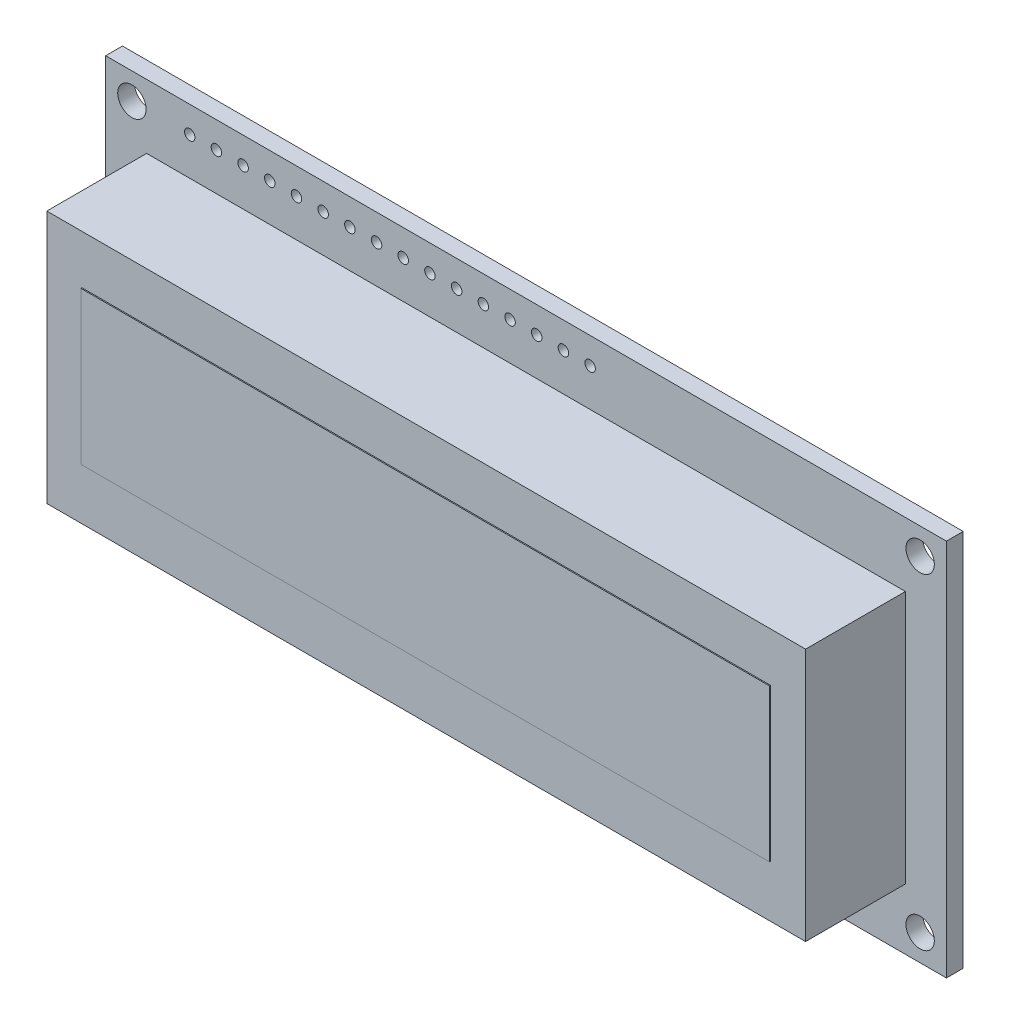
ISO-10303-21;
HEADER;
FILE_DESCRIPTION(('STEP AP214'),'2;1');
FILE_NAME('part.step','',(''),(''),'','','');
FILE_SCHEMA(('AUTOMOTIVE_DESIGN { 1 0 10303 214 1 1 1 1 }'));
ENDSEC;
DATA;
#1=APPLICATION_CONTEXT('core data for automotive mechanical design processes');
#2=APPLICATION_PROTOCOL_DEFINITION('international standard','automotive_design',2000,#1);
#3=PRODUCT_CONTEXT('',#1,'mechanical');
#4=PRODUCT('Part','Part','',(#3));
#5=PRODUCT_RELATED_PRODUCT_CATEGORY('part','',(#4));
#6=PRODUCT_DEFINITION_FORMATION('','',#4);
#7=PRODUCT_DEFINITION_CONTEXT('part definition',#1,'design');
#8=PRODUCT_DEFINITION('design','',#6,#7);
#9=PRODUCT_DEFINITION_SHAPE('','',#8);
#10=(LENGTH_UNIT() NAMED_UNIT(*) SI_UNIT(.MILLI.,.METRE.));
#11=(NAMED_UNIT(*) PLANE_ANGLE_UNIT() SI_UNIT($,.RADIAN.));
#12=(NAMED_UNIT(*) SI_UNIT($,.STERADIAN.) SOLID_ANGLE_UNIT());
#13=UNCERTAINTY_MEASURE_WITH_UNIT(LENGTH_MEASURE(1.E-05),#10,'distance_accuracy_value','');
#14=(GEOMETRIC_REPRESENTATION_CONTEXT(3) GLOBAL_UNCERTAINTY_ASSIGNED_CONTEXT((#13)) GLOBAL_UNIT_ASSIGNED_CONTEXT((#10,
#11,#12)) REPRESENTATION_CONTEXT('',''));
#15=CARTESIAN_POINT('',(0.,0.,0.));
#16=DIRECTION('',(0.,0.,1.));
#17=DIRECTION('',(1.,0.,0.));
#18=AXIS2_PLACEMENT_3D('',#15,#16,#17);
#19=CARTESIAN_POINT('',(0.,0.,1.6));
#20=DIRECTION('',(0.,0.,-1.));
#21=DIRECTION('',(-1.,0.,0.));
#22=AXIS2_PLACEMENT_3D('',#19,#20,#21);
#23=PLANE('',#22);
#24=CARTESIAN_POINT('',(8.,33.5,1.6));
#25=DIRECTION('',(0.,0.,1.));
#26=DIRECTION('',(1.,0.,0.));
#27=AXIS2_PLACEMENT_3D('',#24,#25,#26);
#28=CIRCLE('',#27,0.500000000000001);
#29=CARTESIAN_POINT('',(8.5,33.5,1.6));
#30=VERTEX_POINT('',#29);
#31=EDGE_CURVE('E269',#30,#30,#28,.T.);
#32=ORIENTED_EDGE('',*,*,#31,.F.);
#33=EDGE_LOOP('',(#32));
#34=FACE_BOUND('',#33,.T.);
#35=CARTESIAN_POINT('',(10.54,33.5,1.6));
#36=DIRECTION('',(0.,0.,1.));
#37=DIRECTION('',(1.,0.,0.));
#38=AXIS2_PLACEMENT_3D('',#35,#36,#37);
#39=CIRCLE('',#38,0.500000000000001);
#40=CARTESIAN_POINT('',(11.04,33.5,1.6));
#41=VERTEX_POINT('',#40);
#42=EDGE_CURVE('E365',#41,#41,#39,.T.);
#43=ORIENTED_EDGE('',*,*,#42,.F.);
#44=EDGE_LOOP('',(#43));
#45=FACE_BOUND('',#44,.T.);
#46=CARTESIAN_POINT('',(13.08,33.5,1.6));
#47=DIRECTION('',(0.,0.,1.));
#48=DIRECTION('',(1.,0.,0.));
#49=AXIS2_PLACEMENT_3D('',#46,#47,#48);
#50=CIRCLE('',#49,0.499999999999999);
#51=CARTESIAN_POINT('',(13.58,33.5,1.6));
#52=VERTEX_POINT('',#51);
#53=EDGE_CURVE('E359',#52,#52,#50,.T.);
#54=ORIENTED_EDGE('',*,*,#53,.F.);
#55=EDGE_LOOP('',(#54));
#56=FACE_BOUND('',#55,.T.);
#57=CARTESIAN_POINT('',(15.62,33.5,1.6));
#58=DIRECTION('',(0.,0.,1.));
#59=DIRECTION('',(1.,0.,0.));
#60=AXIS2_PLACEMENT_3D('',#57,#58,#59);
#61=CIRCLE('',#60,0.500000000000001);
#62=CARTESIAN_POINT('',(16.12,33.5,1.6));
#63=VERTEX_POINT('',#62);
#64=EDGE_CURVE('E353',#63,#63,#61,.T.);
#65=ORIENTED_EDGE('',*,*,#64,.F.);
#66=EDGE_LOOP('',(#65));
#67=FACE_BOUND('',#66,.T.);
#68=CARTESIAN_POINT('',(18.16,33.5,1.6));
#69=DIRECTION('',(0.,0.,1.));
#70=DIRECTION('',(1.,0.,0.));
#71=AXIS2_PLACEMENT_3D('',#68,#69,#70);
#72=CIRCLE('',#71,0.499999999999999);
#73=CARTESIAN_POINT('',(18.66,33.5,1.6));
#74=VERTEX_POINT('',#73);
#75=EDGE_CURVE('E347',#74,#74,#72,.T.);
#76=ORIENTED_EDGE('',*,*,#75,.F.);
#77=EDGE_LOOP('',(#76));
#78=FACE_BOUND('',#77,.T.);
#79=CARTESIAN_POINT('',(20.7,33.5,1.6));
#80=DIRECTION('',(0.,0.,1.));
#81=DIRECTION('',(1.,0.,0.));
#82=AXIS2_PLACEMENT_3D('',#79,#80,#81);
#83=CIRCLE('',#82,0.499999999999999);
#84=CARTESIAN_POINT('',(21.2,33.5,1.6));
#85=VERTEX_POINT('',#84);
#86=EDGE_CURVE('E341',#85,#85,#83,.T.);
#87=ORIENTED_EDGE('',*,*,#86,.F.);
#88=EDGE_LOOP('',(#87));
#89=FACE_BOUND('',#88,.T.);
#90=CARTESIAN_POINT('',(23.24,33.5,1.6));
#91=DIRECTION('',(0.,0.,1.));
#92=DIRECTION('',(1.,0.,0.));
#93=AXIS2_PLACEMENT_3D('',#90,#91,#92);
#94=CIRCLE('',#93,0.500000000000003);
#95=CARTESIAN_POINT('',(23.74,33.5,1.6));
#96=VERTEX_POINT('',#95);
#97=EDGE_CURVE('E335',#96,#96,#94,.T.);
#98=ORIENTED_EDGE('',*,*,#97,.F.);
#99=EDGE_LOOP('',(#98));
#100=FACE_BOUND('',#99,.T.);
#101=CARTESIAN_POINT('',(25.78,33.5,1.6));
#102=DIRECTION('',(0.,0.,1.));
#103=DIRECTION('',(1.,0.,0.));
#104=AXIS2_PLACEMENT_3D('',#101,#102,#103);
#105=CIRCLE('',#104,0.500000000000003);
#106=CARTESIAN_POINT('',(26.28,33.5,1.6));
#107=VERTEX_POINT('',#106);
#108=EDGE_CURVE('E329',#107,#107,#105,.T.);
#109=ORIENTED_EDGE('',*,*,#108,.F.);
#110=EDGE_LOOP('',(#109));
#111=FACE_BOUND('',#110,.T.);
#112=CARTESIAN_POINT('',(28.32,33.5,1.6));
#113=DIRECTION('',(0.,0.,1.));
#114=DIRECTION('',(1.,0.,0.));
#115=AXIS2_PLACEMENT_3D('',#112,#113,#114);
#116=CIRCLE('',#115,0.500000000000003);
#117=CARTESIAN_POINT('',(28.82,33.5,1.6));
#118=VERTEX_POINT('',#117);
#119=EDGE_CURVE('E323',#118,#118,#116,.T.);
#120=ORIENTED_EDGE('',*,*,#119,.F.);
#121=EDGE_LOOP('',(#120));
#122=FACE_BOUND('',#121,.T.);
#123=CARTESIAN_POINT('',(30.86,33.5,1.6));
#124=DIRECTION('',(0.,0.,1.));
#125=DIRECTION('',(1.,0.,0.));
#126=AXIS2_PLACEMENT_3D('',#123,#124,#125);
#127=CIRCLE('',#126,0.500000000000003);
#128=CARTESIAN_POINT('',(31.36,33.5,1.6));
#129=VERTEX_POINT('',#128);
#130=EDGE_CURVE('E317',#129,#129,#127,.T.);
#131=ORIENTED_EDGE('',*,*,#130,.F.);
#132=EDGE_LOOP('',(#131));
#133=FACE_BOUND('',#132,.T.);
#134=CARTESIAN_POINT('',(33.4,33.5,1.6));
#135=DIRECTION('',(0.,0.,1.));
#136=DIRECTION('',(1.,0.,0.));
#137=AXIS2_PLACEMENT_3D('',#134,#135,#136);
#138=CIRCLE('',#137,0.500000000000006);
#139=CARTESIAN_POINT('',(33.9,33.5,1.6));
#140=VERTEX_POINT('',#139);
#141=EDGE_CURVE('E311',#140,#140,#138,.T.);
#142=ORIENTED_EDGE('',*,*,#141,.F.);
#143=EDGE_LOOP('',(#142));
#144=FACE_BOUND('',#143,.T.);
#145=CARTESIAN_POINT('',(35.94,33.5,1.6));
#146=DIRECTION('',(0.,0.,1.));
#147=DIRECTION('',(1.,0.,0.));
#148=AXIS2_PLACEMENT_3D('',#145,#146,#147);
#149=CIRCLE('',#148,0.500000000000006);
#150=CARTESIAN_POINT('',(36.44,33.5,1.6));
#151=VERTEX_POINT('',#150);
#152=EDGE_CURVE('E305',#151,#151,#149,.T.);
#153=ORIENTED_EDGE('',*,*,#152,.F.);
#154=EDGE_LOOP('',(#153));
#155=FACE_BOUND('',#154,.T.);
#156=CARTESIAN_POINT('',(38.48,33.5,1.6));
#157=DIRECTION('',(0.,0.,1.));
#158=DIRECTION('',(1.,0.,0.));
#159=AXIS2_PLACEMENT_3D('',#156,#157,#158);
#160=CIRCLE('',#159,0.499999999999999);
#161=CARTESIAN_POINT('',(38.98,33.5,1.6));
#162=VERTEX_POINT('',#161);
#163=EDGE_CURVE('E299',#162,#162,#160,.T.);
#164=ORIENTED_EDGE('',*,*,#163,.F.);
#165=EDGE_LOOP('',(#164));
#166=FACE_BOUND('',#165,.T.);
#167=CARTESIAN_POINT('',(41.02,33.5,1.6));
#168=DIRECTION('',(0.,0.,1.));
#169=DIRECTION('',(1.,0.,0.));
#170=AXIS2_PLACEMENT_3D('',#167,#168,#169);
#171=CIRCLE('',#170,0.499999999999999);
#172=CARTESIAN_POINT('',(41.52,33.5,1.6));
#173=VERTEX_POINT('',#172);
#174=EDGE_CURVE('E293',#173,#173,#171,.T.);
#175=ORIENTED_EDGE('',*,*,#174,.F.);
#176=EDGE_LOOP('',(#175));
#177=FACE_BOUND('',#176,.T.);
#178=CARTESIAN_POINT('',(43.56,33.5,1.6));
#179=DIRECTION('',(0.,0.,1.));
#180=DIRECTION('',(1.,0.,0.));
#181=AXIS2_PLACEMENT_3D('',#178,#179,#180);
#182=CIRCLE('',#181,0.499999999999999);
#183=CARTESIAN_POINT('',(44.06,33.5,1.6));
#184=VERTEX_POINT('',#183);
#185=EDGE_CURVE('E287',#184,#184,#182,.T.);
#186=ORIENTED_EDGE('',*,*,#185,.F.);
#187=EDGE_LOOP('',(#186));
#188=FACE_BOUND('',#187,.T.);
#189=CARTESIAN_POINT('',(46.1,33.5,1.6));
#190=DIRECTION('',(0.,0.,1.));
#191=DIRECTION('',(1.,0.,0.));
#192=AXIS2_PLACEMENT_3D('',#189,#190,#191);
#193=CIRCLE('',#192,0.499999999999999);
#194=CARTESIAN_POINT('',(46.6,33.5,1.6));
#195=VERTEX_POINT('',#194);
#196=EDGE_CURVE('E281',#195,#195,#193,.T.);
#197=ORIENTED_EDGE('',*,*,#196,.F.);
#198=EDGE_LOOP('',(#197));
#199=FACE_BOUND('',#198,.T.);
#200=DIRECTION('',(0.,-1.,0.));
#201=VECTOR('',#200,1.);
#202=CARTESIAN_POINT('',(0.,0.,1.6));
#203=LINE('',#202,#201);
#204=CARTESIAN_POINT('',(0.,36.,1.6));
#205=VERTEX_POINT('',#204);
#206=CARTESIAN_POINT('',(0.,0.,1.6));
#207=VERTEX_POINT('',#206);
#208=EDGE_CURVE('E203',#205,#207,#203,.T.);
#209=ORIENTED_EDGE('',*,*,#208,.T.);
#210=DIRECTION('',(1.,0.,0.));
#211=VECTOR('',#210,1.);
#212=CARTESIAN_POINT('',(0.,0.,1.6));
#213=LINE('',#212,#211);
#214=CARTESIAN_POINT('',(80.,0.,1.6));
#215=VERTEX_POINT('',#214);
#216=EDGE_CURVE('E206',#207,#215,#213,.T.);
#217=ORIENTED_EDGE('',*,*,#216,.T.);
#218=DIRECTION('',(0.,1.,0.));
#219=VECTOR('',#218,1.);
#220=CARTESIAN_POINT('',(80.,0.,1.6));
#221=LINE('',#220,#219);
#222=CARTESIAN_POINT('',(80.,36.,1.6));
#223=VERTEX_POINT('',#222);
#224=EDGE_CURVE('E209',#215,#223,#221,.T.);
#225=ORIENTED_EDGE('',*,*,#224,.T.);
#226=DIRECTION('',(-1.,0.,0.));
#227=VECTOR('',#226,1.);
#228=CARTESIAN_POINT('',(0.,36.,1.6));
#229=LINE('',#228,#227);
#230=EDGE_CURVE('E211',#223,#205,#229,.T.);
#231=ORIENTED_EDGE('',*,*,#230,.T.);
#232=EDGE_LOOP('',(#209,#217,#225,#231));
#233=FACE_BOUND('',#232,.T.);
#234=CARTESIAN_POINT('',(2.5,33.5,1.6));
#235=DIRECTION('',(0.,0.,1.));
#236=DIRECTION('',(1.,0.,0.));
#237=AXIS2_PLACEMENT_3D('',#234,#235,#236);
#238=CIRCLE('',#237,1.35);
#239=CARTESIAN_POINT('',(3.85,33.5,1.6));
#240=VERTEX_POINT('',#239);
#241=EDGE_CURVE('E197',#240,#240,#238,.T.);
#242=ORIENTED_EDGE('',*,*,#241,.F.);
#243=EDGE_LOOP('',(#242));
#244=FACE_BOUND('',#243,.T.);
#245=CARTESIAN_POINT('',(2.5,2.5,1.6));
#246=DIRECTION('',(0.,0.,1.));
#247=DIRECTION('',(1.,0.,0.));
#248=AXIS2_PLACEMENT_3D('',#245,#246,#247);
#249=CIRCLE('',#248,1.35);
#250=CARTESIAN_POINT('',(3.85,2.5,1.6));
#251=VERTEX_POINT('',#250);
#252=EDGE_CURVE('E191',#251,#251,#249,.T.);
#253=ORIENTED_EDGE('',*,*,#252,.F.);
#254=EDGE_LOOP('',(#253));
#255=FACE_BOUND('',#254,.T.);
#256=CARTESIAN_POINT('',(77.5,33.5,1.6));
#257=DIRECTION('',(0.,0.,1.));
#258=DIRECTION('',(1.,0.,0.));
#259=AXIS2_PLACEMENT_3D('',#256,#257,#258);
#260=CIRCLE('',#259,1.35000000000001);
#261=CARTESIAN_POINT('',(78.85,33.5,1.6));
#262=VERTEX_POINT('',#261);
#263=EDGE_CURVE('E185',#262,#262,#260,.T.);
#264=ORIENTED_EDGE('',*,*,#263,.F.);
#265=EDGE_LOOP('',(#264));
#266=FACE_BOUND('',#265,.T.);
#267=CARTESIAN_POINT('',(77.5,2.5,1.6));
#268=DIRECTION('',(0.,0.,1.));
#269=DIRECTION('',(1.,0.,0.));
#270=AXIS2_PLACEMENT_3D('',#267,#268,#269);
#271=CIRCLE('',#270,1.35000000000001);
#272=CARTESIAN_POINT('',(78.85,2.5,1.6));
#273=VERTEX_POINT('',#272);
#274=EDGE_CURVE('E179',#273,#273,#271,.T.);
#275=ORIENTED_EDGE('',*,*,#274,.F.);
#276=EDGE_LOOP('',(#275));
#277=FACE_BOUND('',#276,.T.);
#278=DIRECTION('',(0.,-1.,0.));
#279=VECTOR('',#278,1.);
#280=CARTESIAN_POINT('',(3.89999999999999,29.9,1.6));
#281=LINE('',#280,#279);
#282=CARTESIAN_POINT('',(3.89999999999999,29.9,1.6));
#283=VERTEX_POINT('',#282);
#284=CARTESIAN_POINT('',(3.9,5.8,1.6));
#285=VERTEX_POINT('',#284);
#286=EDGE_CURVE('E143',#283,#285,#281,.T.);
#287=ORIENTED_EDGE('',*,*,#286,.F.);
#288=DIRECTION('',(1.,0.,0.));
#289=VECTOR('',#288,1.);
#290=CARTESIAN_POINT('',(3.89999999999999,29.9,1.6));
#291=LINE('',#290,#289);
#292=CARTESIAN_POINT('',(76.1,29.9,1.6));
#293=VERTEX_POINT('',#292);
#294=EDGE_CURVE('E139',#283,#293,#291,.T.);
#295=ORIENTED_EDGE('',*,*,#294,.T.);
#296=DIRECTION('',(0.,-1.,0.));
#297=VECTOR('',#296,1.);
#298=CARTESIAN_POINT('',(76.1,29.9,1.6));
#299=LINE('',#298,#297);
#300=CARTESIAN_POINT('',(76.1,5.80000000000001,1.6));
#301=VERTEX_POINT('',#300);
#302=EDGE_CURVE('E47',#293,#301,#299,.T.);
#303=ORIENTED_EDGE('',*,*,#302,.T.);
#304=DIRECTION('',(1.,0.,0.));
#305=VECTOR('',#304,1.);
#306=CARTESIAN_POINT('',(3.9,5.8,1.6));
#307=LINE('',#306,#305);
#308=EDGE_CURVE('E264',#285,#301,#307,.T.);
#309=ORIENTED_EDGE('',*,*,#308,.F.);
#310=EDGE_LOOP('',(#287,#295,#303,#309));
#311=FACE_BOUND('',#310,.T.);
#312=ADVANCED_FACE('F32',(#34,#45,#56,#67,#78,#89,#100,#111,#122,#133,#144,#155,#166,#177,#188,
#199,#233,#244,#255,#266,#277,#311),#23,.F.);
#313=CARTESIAN_POINT('',(0.,0.,0.));
#314=DIRECTION('',(0.,0.,-1.));
#315=DIRECTION('',(-1.,0.,0.));
#316=AXIS2_PLACEMENT_3D('',#313,#314,#315);
#317=PLANE('',#316);
#318=CARTESIAN_POINT('',(8.,33.5,0.));
#319=DIRECTION('',(0.,0.,1.));
#320=DIRECTION('',(1.,0.,0.));
#321=AXIS2_PLACEMENT_3D('',#318,#319,#320);
#322=CIRCLE('',#321,0.500000000000001);
#323=CARTESIAN_POINT('',(8.5,33.5,0.));
#324=VERTEX_POINT('',#323);
#325=EDGE_CURVE('E265',#324,#324,#322,.T.);
#326=ORIENTED_EDGE('',*,*,#325,.T.);
#327=EDGE_LOOP('',(#326));
#328=FACE_BOUND('',#327,.T.);
#329=CARTESIAN_POINT('',(10.54,33.5,0.));
#330=DIRECTION('',(0.,0.,1.));
#331=DIRECTION('',(1.,0.,0.));
#332=AXIS2_PLACEMENT_3D('',#329,#330,#331);
#333=CIRCLE('',#332,0.500000000000001);
#334=CARTESIAN_POINT('',(11.04,33.5,0.));
#335=VERTEX_POINT('',#334);
#336=EDGE_CURVE('E368',#335,#335,#333,.T.);
#337=ORIENTED_EDGE('',*,*,#336,.T.);
#338=EDGE_LOOP('',(#337));
#339=FACE_BOUND('',#338,.T.);
#340=CARTESIAN_POINT('',(13.08,33.5,0.));
#341=DIRECTION('',(0.,0.,1.));
#342=DIRECTION('',(1.,0.,0.));
#343=AXIS2_PLACEMENT_3D('',#340,#341,#342);
#344=CIRCLE('',#343,0.499999999999999);
#345=CARTESIAN_POINT('',(13.58,33.5,0.));
#346=VERTEX_POINT('',#345);
#347=EDGE_CURVE('E362',#346,#346,#344,.T.);
#348=ORIENTED_EDGE('',*,*,#347,.T.);
#349=EDGE_LOOP('',(#348));
#350=FACE_BOUND('',#349,.T.);
#351=CARTESIAN_POINT('',(15.62,33.5,0.));
#352=DIRECTION('',(0.,0.,1.));
#353=DIRECTION('',(1.,0.,0.));
#354=AXIS2_PLACEMENT_3D('',#351,#352,#353);
#355=CIRCLE('',#354,0.500000000000001);
#356=CARTESIAN_POINT('',(16.12,33.5,0.));
#357=VERTEX_POINT('',#356);
#358=EDGE_CURVE('E356',#357,#357,#355,.T.);
#359=ORIENTED_EDGE('',*,*,#358,.T.);
#360=EDGE_LOOP('',(#359));
#361=FACE_BOUND('',#360,.T.);
#362=CARTESIAN_POINT('',(18.16,33.5,0.));
#363=DIRECTION('',(0.,0.,1.));
#364=DIRECTION('',(1.,0.,0.));
#365=AXIS2_PLACEMENT_3D('',#362,#363,#364);
#366=CIRCLE('',#365,0.499999999999999);
#367=CARTESIAN_POINT('',(18.66,33.5,0.));
#368=VERTEX_POINT('',#367);
#369=EDGE_CURVE('E350',#368,#368,#366,.T.);
#370=ORIENTED_EDGE('',*,*,#369,.T.);
#371=EDGE_LOOP('',(#370));
#372=FACE_BOUND('',#371,.T.);
#373=CARTESIAN_POINT('',(20.7,33.5,0.));
#374=DIRECTION('',(0.,0.,1.));
#375=DIRECTION('',(1.,0.,0.));
#376=AXIS2_PLACEMENT_3D('',#373,#374,#375);
#377=CIRCLE('',#376,0.499999999999999);
#378=CARTESIAN_POINT('',(21.2,33.5,0.));
#379=VERTEX_POINT('',#378);
#380=EDGE_CURVE('E344',#379,#379,#377,.T.);
#381=ORIENTED_EDGE('',*,*,#380,.T.);
#382=EDGE_LOOP('',(#381));
#383=FACE_BOUND('',#382,.T.);
#384=CARTESIAN_POINT('',(23.24,33.5,0.));
#385=DIRECTION('',(0.,0.,1.));
#386=DIRECTION('',(1.,0.,0.));
#387=AXIS2_PLACEMENT_3D('',#384,#385,#386);
#388=CIRCLE('',#387,0.500000000000003);
#389=CARTESIAN_POINT('',(23.74,33.5,0.));
#390=VERTEX_POINT('',#389);
#391=EDGE_CURVE('E338',#390,#390,#388,.T.);
#392=ORIENTED_EDGE('',*,*,#391,.T.);
#393=EDGE_LOOP('',(#392));
#394=FACE_BOUND('',#393,.T.);
#395=CARTESIAN_POINT('',(25.78,33.5,0.));
#396=DIRECTION('',(0.,0.,1.));
#397=DIRECTION('',(1.,0.,0.));
#398=AXIS2_PLACEMENT_3D('',#395,#396,#397);
#399=CIRCLE('',#398,0.500000000000003);
#400=CARTESIAN_POINT('',(26.28,33.5,0.));
#401=VERTEX_POINT('',#400);
#402=EDGE_CURVE('E332',#401,#401,#399,.T.);
#403=ORIENTED_EDGE('',*,*,#402,.T.);
#404=EDGE_LOOP('',(#403));
#405=FACE_BOUND('',#404,.T.);
#406=CARTESIAN_POINT('',(28.32,33.5,0.));
#407=DIRECTION('',(0.,0.,1.));
#408=DIRECTION('',(1.,0.,0.));
#409=AXIS2_PLACEMENT_3D('',#406,#407,#408);
#410=CIRCLE('',#409,0.500000000000003);
#411=CARTESIAN_POINT('',(28.82,33.5,0.));
#412=VERTEX_POINT('',#411);
#413=EDGE_CURVE('E326',#412,#412,#410,.T.);
#414=ORIENTED_EDGE('',*,*,#413,.T.);
#415=EDGE_LOOP('',(#414));
#416=FACE_BOUND('',#415,.T.);
#417=CARTESIAN_POINT('',(30.86,33.5,0.));
#418=DIRECTION('',(0.,0.,1.));
#419=DIRECTION('',(1.,0.,0.));
#420=AXIS2_PLACEMENT_3D('',#417,#418,#419);
#421=CIRCLE('',#420,0.500000000000003);
#422=CARTESIAN_POINT('',(31.36,33.5,0.));
#423=VERTEX_POINT('',#422);
#424=EDGE_CURVE('E320',#423,#423,#421,.T.);
#425=ORIENTED_EDGE('',*,*,#424,.T.);
#426=EDGE_LOOP('',(#425));
#427=FACE_BOUND('',#426,.T.);
#428=CARTESIAN_POINT('',(33.4,33.5,0.));
#429=DIRECTION('',(0.,0.,1.));
#430=DIRECTION('',(1.,0.,0.));
#431=AXIS2_PLACEMENT_3D('',#428,#429,#430);
#432=CIRCLE('',#431,0.500000000000006);
#433=CARTESIAN_POINT('',(33.9,33.5,0.));
#434=VERTEX_POINT('',#433);
#435=EDGE_CURVE('E314',#434,#434,#432,.T.);
#436=ORIENTED_EDGE('',*,*,#435,.T.);
#437=EDGE_LOOP('',(#436));
#438=FACE_BOUND('',#437,.T.);
#439=CARTESIAN_POINT('',(35.94,33.5,0.));
#440=DIRECTION('',(0.,0.,1.));
#441=DIRECTION('',(1.,0.,0.));
#442=AXIS2_PLACEMENT_3D('',#439,#440,#441);
#443=CIRCLE('',#442,0.500000000000006);
#444=CARTESIAN_POINT('',(36.44,33.5,0.));
#445=VERTEX_POINT('',#444);
#446=EDGE_CURVE('E308',#445,#445,#443,.T.);
#447=ORIENTED_EDGE('',*,*,#446,.T.);
#448=EDGE_LOOP('',(#447));
#449=FACE_BOUND('',#448,.T.);
#450=CARTESIAN_POINT('',(38.48,33.5,0.));
#451=DIRECTION('',(0.,0.,1.));
#452=DIRECTION('',(1.,0.,0.));
#453=AXIS2_PLACEMENT_3D('',#450,#451,#452);
#454=CIRCLE('',#453,0.499999999999999);
#455=CARTESIAN_POINT('',(38.98,33.5,0.));
#456=VERTEX_POINT('',#455);
#457=EDGE_CURVE('E302',#456,#456,#454,.T.);
#458=ORIENTED_EDGE('',*,*,#457,.T.);
#459=EDGE_LOOP('',(#458));
#460=FACE_BOUND('',#459,.T.);
#461=CARTESIAN_POINT('',(41.02,33.5,0.));
#462=DIRECTION('',(0.,0.,1.));
#463=DIRECTION('',(1.,0.,0.));
#464=AXIS2_PLACEMENT_3D('',#461,#462,#463);
#465=CIRCLE('',#464,0.499999999999999);
#466=CARTESIAN_POINT('',(41.52,33.5,0.));
#467=VERTEX_POINT('',#466);
#468=EDGE_CURVE('E296',#467,#467,#465,.T.);
#469=ORIENTED_EDGE('',*,*,#468,.T.);
#470=EDGE_LOOP('',(#469));
#471=FACE_BOUND('',#470,.T.);
#472=CARTESIAN_POINT('',(43.56,33.5,0.));
#473=DIRECTION('',(0.,0.,1.));
#474=DIRECTION('',(1.,0.,0.));
#475=AXIS2_PLACEMENT_3D('',#472,#473,#474);
#476=CIRCLE('',#475,0.499999999999999);
#477=CARTESIAN_POINT('',(44.06,33.5,0.));
#478=VERTEX_POINT('',#477);
#479=EDGE_CURVE('E290',#478,#478,#476,.T.);
#480=ORIENTED_EDGE('',*,*,#479,.T.);
#481=EDGE_LOOP('',(#480));
#482=FACE_BOUND('',#481,.T.);
#483=CARTESIAN_POINT('',(46.1,33.5,0.));
#484=DIRECTION('',(0.,0.,1.));
#485=DIRECTION('',(1.,0.,0.));
#486=AXIS2_PLACEMENT_3D('',#483,#484,#485);
#487=CIRCLE('',#486,0.499999999999999);
#488=CARTESIAN_POINT('',(46.6,33.5,0.));
#489=VERTEX_POINT('',#488);
#490=EDGE_CURVE('E284',#489,#489,#487,.T.);
#491=ORIENTED_EDGE('',*,*,#490,.T.);
#492=EDGE_LOOP('',(#491));
#493=FACE_BOUND('',#492,.T.);
#494=CARTESIAN_POINT('',(77.5,33.5,0.));
#495=DIRECTION('',(0.,0.,1.));
#496=DIRECTION('',(1.,0.,0.));
#497=AXIS2_PLACEMENT_3D('',#494,#495,#496);
#498=CIRCLE('',#497,1.35000000000001);
#499=CARTESIAN_POINT('',(78.85,33.5,0.));
#500=VERTEX_POINT('',#499);
#501=EDGE_CURVE('E182',#500,#500,#498,.T.);
#502=ORIENTED_EDGE('',*,*,#501,.T.);
#503=EDGE_LOOP('',(#502));
#504=FACE_BOUND('',#503,.T.);
#505=CARTESIAN_POINT('',(2.5,33.5,0.));
#506=DIRECTION('',(0.,0.,1.));
#507=DIRECTION('',(1.,0.,0.));
#508=AXIS2_PLACEMENT_3D('',#505,#506,#507);
#509=CIRCLE('',#508,1.35);
#510=CARTESIAN_POINT('',(3.85,33.5,0.));
#511=VERTEX_POINT('',#510);
#512=EDGE_CURVE('E194',#511,#511,#509,.T.);
#513=ORIENTED_EDGE('',*,*,#512,.T.);
#514=EDGE_LOOP('',(#513));
#515=FACE_BOUND('',#514,.T.);
#516=DIRECTION('',(0.,-1.,0.));
#517=VECTOR('',#516,1.);
#518=CARTESIAN_POINT('',(0.,0.,0.));
#519=LINE('',#518,#517);
#520=CARTESIAN_POINT('',(0.,36.,0.));
#521=VERTEX_POINT('',#520);
#522=CARTESIAN_POINT('',(0.,0.,0.));
#523=VERTEX_POINT('',#522);
#524=EDGE_CURVE('E200',#521,#523,#519,.T.);
#525=ORIENTED_EDGE('',*,*,#524,.F.);
#526=DIRECTION('',(-1.,0.,0.));
#527=VECTOR('',#526,1.);
#528=CARTESIAN_POINT('',(0.,36.,0.));
#529=LINE('',#528,#527);
#530=CARTESIAN_POINT('',(80.,36.,0.));
#531=VERTEX_POINT('',#530);
#532=EDGE_CURVE('E207',#531,#521,#529,.T.);
#533=ORIENTED_EDGE('',*,*,#532,.F.);
#534=DIRECTION('',(0.,1.,0.));
#535=VECTOR('',#534,1.);
#536=CARTESIAN_POINT('',(80.,0.,0.));
#537=LINE('',#536,#535);
#538=CARTESIAN_POINT('',(80.,0.,0.));
#539=VERTEX_POINT('',#538);
#540=EDGE_CURVE('E218',#539,#531,#537,.T.);
#541=ORIENTED_EDGE('',*,*,#540,.F.);
#542=DIRECTION('',(1.,0.,0.));
#543=VECTOR('',#542,1.);
#544=CARTESIAN_POINT('',(0.,0.,0.));
#545=LINE('',#544,#543);
#546=EDGE_CURVE('E216',#523,#539,#545,.T.);
#547=ORIENTED_EDGE('',*,*,#546,.F.);
#548=EDGE_LOOP('',(#525,#533,#541,#547));
#549=FACE_BOUND('',#548,.T.);
#550=CARTESIAN_POINT('',(2.5,2.5,0.));
#551=DIRECTION('',(0.,0.,1.));
#552=DIRECTION('',(1.,0.,0.));
#553=AXIS2_PLACEMENT_3D('',#550,#551,#552);
#554=CIRCLE('',#553,1.35);
#555=CARTESIAN_POINT('',(3.85,2.5,0.));
#556=VERTEX_POINT('',#555);
#557=EDGE_CURVE('E188',#556,#556,#554,.T.);
#558=ORIENTED_EDGE('',*,*,#557,.T.);
#559=EDGE_LOOP('',(#558));
#560=FACE_BOUND('',#559,.T.);
#561=CARTESIAN_POINT('',(77.5,2.5,0.));
#562=DIRECTION('',(0.,0.,1.));
#563=DIRECTION('',(1.,0.,0.));
#564=AXIS2_PLACEMENT_3D('',#561,#562,#563);
#565=CIRCLE('',#564,1.35000000000001);
#566=CARTESIAN_POINT('',(78.85,2.5,0.));
#567=VERTEX_POINT('',#566);
#568=EDGE_CURVE('E178',#567,#567,#565,.T.);
#569=ORIENTED_EDGE('',*,*,#568,.T.);
#570=EDGE_LOOP('',(#569));
#571=FACE_BOUND('',#570,.T.);
#572=ADVANCED_FACE('F239',(#328,#339,#350,#361,#372,#383,#394,#405,#416,#427,#438,#449,#460,
#471,#482,#493,#504,#515,#549,#560,#571),#317,.T.);
#573=CARTESIAN_POINT('',(0.,0.,1.6));
#574=DIRECTION('',(1.,0.,0.));
#575=DIRECTION('',(0.,0.,-1.));
#576=AXIS2_PLACEMENT_3D('',#573,#574,#575);
#577=PLANE('',#576);
#578=ORIENTED_EDGE('',*,*,#524,.T.);
#579=DIRECTION('',(0.,0.,-1.));
#580=VECTOR('',#579,1.);
#581=CARTESIAN_POINT('',(0.,0.,1.6));
#582=LINE('',#581,#580);
#583=EDGE_CURVE('E40',#207,#523,#582,.T.);
#584=ORIENTED_EDGE('',*,*,#583,.F.);
#585=ORIENTED_EDGE('',*,*,#208,.F.);
#586=DIRECTION('',(0.,0.,-1.));
#587=VECTOR('',#586,1.);
#588=CARTESIAN_POINT('',(0.,36.,1.6));
#589=LINE('',#588,#587);
#590=EDGE_CURVE('E213',#205,#521,#589,.T.);
#591=ORIENTED_EDGE('',*,*,#590,.T.);
#592=EDGE_LOOP('',(#578,#584,#585,#591));
#593=FACE_BOUND('',#592,.T.);
#594=ADVANCED_FACE('F34',(#593),#577,.F.);
#595=CARTESIAN_POINT('',(0.,0.,1.6));
#596=DIRECTION('',(0.,1.,0.));
#597=DIRECTION('',(0.,0.,1.));
#598=AXIS2_PLACEMENT_3D('',#595,#596,#597);
#599=PLANE('',#598);
#600=ORIENTED_EDGE('',*,*,#546,.T.);
#601=DIRECTION('',(0.,0.,-1.));
#602=VECTOR('',#601,1.);
#603=CARTESIAN_POINT('',(80.,0.,1.6));
#604=LINE('',#603,#602);
#605=EDGE_CURVE('E226',#215,#539,#604,.T.);
#606=ORIENTED_EDGE('',*,*,#605,.F.);
#607=ORIENTED_EDGE('',*,*,#216,.F.);
#608=ORIENTED_EDGE('',*,*,#583,.T.);
#609=EDGE_LOOP('',(#600,#606,#607,#608));
#610=FACE_BOUND('',#609,.T.);
#611=ADVANCED_FACE('F231',(#610),#599,.F.);
#612=CARTESIAN_POINT('',(80.,0.,1.6));
#613=DIRECTION('',(-1.,0.,0.));
#614=DIRECTION('',(0.,0.,1.));
#615=AXIS2_PLACEMENT_3D('',#612,#613,#614);
#616=PLANE('',#615);
#617=ORIENTED_EDGE('',*,*,#540,.T.);
#618=DIRECTION('',(0.,0.,-1.));
#619=VECTOR('',#618,1.);
#620=CARTESIAN_POINT('',(80.,36.,1.6));
#621=LINE('',#620,#619);
#622=EDGE_CURVE('E223',#223,#531,#621,.T.);
#623=ORIENTED_EDGE('',*,*,#622,.F.);
#624=ORIENTED_EDGE('',*,*,#224,.F.);
#625=ORIENTED_EDGE('',*,*,#605,.T.);
#626=EDGE_LOOP('',(#617,#623,#624,#625));
#627=FACE_BOUND('',#626,.T.);
#628=ADVANCED_FACE('F244',(#627),#616,.F.);
#629=CARTESIAN_POINT('',(0.,36.,1.6));
#630=DIRECTION('',(0.,-1.,0.));
#631=DIRECTION('',(0.,0.,-1.));
#632=AXIS2_PLACEMENT_3D('',#629,#630,#631);
#633=PLANE('',#632);
#634=ORIENTED_EDGE('',*,*,#532,.T.);
#635=ORIENTED_EDGE('',*,*,#590,.F.);
#636=ORIENTED_EDGE('',*,*,#230,.F.);
#637=ORIENTED_EDGE('',*,*,#622,.T.);
#638=EDGE_LOOP('',(#634,#635,#636,#637));
#639=FACE_BOUND('',#638,.T.);
#640=ADVANCED_FACE('F248',(#639),#633,.F.);
#641=CARTESIAN_POINT('',(2.5,33.5,1.6));
#642=DIRECTION('',(0.,0.,-1.));
#643=DIRECTION('',(-1.,0.,0.));
#644=AXIS2_PLACEMENT_3D('',#641,#642,#643);
#645=CYLINDRICAL_SURFACE('',#644,1.35);
#646=ORIENTED_EDGE('',*,*,#241,.T.);
#647=EDGE_LOOP('',(#646));
#648=FACE_BOUND('',#647,.T.);
#649=ORIENTED_EDGE('',*,*,#512,.F.);
#650=EDGE_LOOP('',(#649));
#651=FACE_BOUND('',#650,.T.);
#652=ADVANCED_FACE('F461',(#648,#651),#645,.F.);
#653=CARTESIAN_POINT('',(2.5,2.5,1.6));
#654=DIRECTION('',(0.,0.,-1.));
#655=DIRECTION('',(-1.,0.,0.));
#656=AXIS2_PLACEMENT_3D('',#653,#654,#655);
#657=CYLINDRICAL_SURFACE('',#656,1.35);
#658=ORIENTED_EDGE('',*,*,#252,.T.);
#659=EDGE_LOOP('',(#658));
#660=FACE_BOUND('',#659,.T.);
#661=ORIENTED_EDGE('',*,*,#557,.F.);
#662=EDGE_LOOP('',(#661));
#663=FACE_BOUND('',#662,.T.);
#664=ADVANCED_FACE('F457',(#660,#663),#657,.F.);
#665=CARTESIAN_POINT('',(77.5,33.5,1.6));
#666=DIRECTION('',(0.,0.,-1.));
#667=DIRECTION('',(-1.,0.,0.));
#668=AXIS2_PLACEMENT_3D('',#665,#666,#667);
#669=CYLINDRICAL_SURFACE('',#668,1.35000000000001);
#670=ORIENTED_EDGE('',*,*,#263,.T.);
#671=EDGE_LOOP('',(#670));
#672=FACE_BOUND('',#671,.T.);
#673=ORIENTED_EDGE('',*,*,#501,.F.);
#674=EDGE_LOOP('',(#673));
#675=FACE_BOUND('',#674,.T.);
#676=ADVANCED_FACE('F453',(#672,#675),#669,.F.);
#677=CARTESIAN_POINT('',(77.5,2.5,1.6));
#678=DIRECTION('',(0.,0.,-1.));
#679=DIRECTION('',(-1.,0.,0.));
#680=AXIS2_PLACEMENT_3D('',#677,#678,#679);
#681=CYLINDRICAL_SURFACE('',#680,1.35000000000001);
#682=ORIENTED_EDGE('',*,*,#274,.T.);
#683=EDGE_LOOP('',(#682));
#684=FACE_BOUND('',#683,.T.);
#685=ORIENTED_EDGE('',*,*,#568,.F.);
#686=EDGE_LOOP('',(#685));
#687=FACE_BOUND('',#686,.T.);
#688=ADVANCED_FACE('F427',(#684,#687),#681,.F.);
#689=CARTESIAN_POINT('',(0.,0.,11.1));
#690=DIRECTION('',(0.,0.,1.));
#691=DIRECTION('',(1.,0.,0.));
#692=AXIS2_PLACEMENT_3D('',#689,#690,#691);
#693=PLANE('',#692);
#694=DIRECTION('',(0.,-1.,0.));
#695=VECTOR('',#694,1.);
#696=CARTESIAN_POINT('',(3.89999999999999,29.9,11.1));
#697=LINE('',#696,#695);
#698=CARTESIAN_POINT('',(3.89999999999999,29.9,11.1));
#699=VERTEX_POINT('',#698);
#700=CARTESIAN_POINT('',(3.9,5.8,11.1));
#701=VERTEX_POINT('',#700);
#702=EDGE_CURVE('E131',#699,#701,#697,.T.);
#703=ORIENTED_EDGE('',*,*,#702,.T.);
#704=DIRECTION('',(1.,0.,0.));
#705=VECTOR('',#704,1.);
#706=CARTESIAN_POINT('',(3.9,5.8,11.1));
#707=LINE('',#706,#705);
#708=CARTESIAN_POINT('',(76.1,5.80000000000001,11.1));
#709=VERTEX_POINT('',#708);
#710=EDGE_CURVE('E119',#701,#709,#707,.T.);
#711=ORIENTED_EDGE('',*,*,#710,.T.);
#712=DIRECTION('',(0.,-1.,0.));
#713=VECTOR('',#712,1.);
#714=CARTESIAN_POINT('',(76.1,29.9,11.1));
#715=LINE('',#714,#713);
#716=CARTESIAN_POINT('',(76.1,29.9,11.1));
#717=VERTEX_POINT('',#716);
#718=EDGE_CURVE('E130',#717,#709,#715,.T.);
#719=ORIENTED_EDGE('',*,*,#718,.F.);
#720=DIRECTION('',(1.,0.,0.));
#721=VECTOR('',#720,1.);
#722=CARTESIAN_POINT('',(3.89999999999999,29.9,11.1));
#723=LINE('',#722,#721);
#724=EDGE_CURVE('E137',#699,#717,#723,.T.);
#725=ORIENTED_EDGE('',*,*,#724,.F.);
#726=EDGE_LOOP('',(#703,#711,#719,#725));
#727=FACE_BOUND('',#726,.T.);
#728=DIRECTION('',(0.,-1.,0.));
#729=VECTOR('',#728,1.);
#730=CARTESIAN_POINT('',(7.25,25.25,11.1));
#731=LINE('',#730,#729);
#732=CARTESIAN_POINT('',(7.25,25.25,11.1));
#733=VERTEX_POINT('',#732);
#734=CARTESIAN_POINT('',(7.25,10.75,11.1));
#735=VERTEX_POINT('',#734);
#736=EDGE_CURVE('E55',#733,#735,#731,.T.);
#737=ORIENTED_EDGE('',*,*,#736,.F.);
#738=DIRECTION('',(-1.,0.,0.));
#739=VECTOR('',#738,1.);
#740=CARTESIAN_POINT('',(7.25,25.25,11.1));
#741=LINE('',#740,#739);
#742=CARTESIAN_POINT('',(72.75,25.25,11.1));
#743=VERTEX_POINT('',#742);
#744=EDGE_CURVE('E11',#743,#733,#741,.T.);
#745=ORIENTED_EDGE('',*,*,#744,.F.);
#746=DIRECTION('',(0.,1.,0.));
#747=VECTOR('',#746,1.);
#748=CARTESIAN_POINT('',(72.75,25.25,11.1));
#749=LINE('',#748,#747);
#750=CARTESIAN_POINT('',(72.75,10.75,11.1));
#751=VERTEX_POINT('',#750);
#752=EDGE_CURVE('E145',#751,#743,#749,.T.);
#753=ORIENTED_EDGE('',*,*,#752,.F.);
#754=DIRECTION('',(1.,0.,0.));
#755=VECTOR('',#754,1.);
#756=CARTESIAN_POINT('',(7.25,10.75,11.1));
#757=LINE('',#756,#755);
#758=EDGE_CURVE('E148',#735,#751,#757,.T.);
#759=ORIENTED_EDGE('',*,*,#758,.F.);
#760=EDGE_LOOP('',(#737,#745,#753,#759));
#761=FACE_BOUND('',#760,.T.);
#762=ADVANCED_FACE('F135',(#727,#761),#693,.T.);
#763=CARTESIAN_POINT('',(3.89999999999999,29.9,11.1));
#764=DIRECTION('',(1.,0.,0.));
#765=DIRECTION('',(0.,1.,0.));
#766=AXIS2_PLACEMENT_3D('',#763,#764,#765);
#767=PLANE('',#766);
#768=ORIENTED_EDGE('',*,*,#286,.T.);
#769=DIRECTION('',(0.,0.,-1.));
#770=VECTOR('',#769,1.);
#771=CARTESIAN_POINT('',(3.9,5.8,11.1));
#772=LINE('',#771,#770);
#773=EDGE_CURVE('E124',#701,#285,#772,.T.);
#774=ORIENTED_EDGE('',*,*,#773,.F.);
#775=ORIENTED_EDGE('',*,*,#702,.F.);
#776=DIRECTION('',(0.,0.,-1.));
#777=VECTOR('',#776,1.);
#778=CARTESIAN_POINT('',(3.89999999999999,29.9,11.1));
#779=LINE('',#778,#777);
#780=EDGE_CURVE('E276',#699,#283,#779,.T.);
#781=ORIENTED_EDGE('',*,*,#780,.T.);
#782=EDGE_LOOP('',(#768,#774,#775,#781));
#783=FACE_BOUND('',#782,.T.);
#784=ADVANCED_FACE('F141',(#783),#767,.F.);
#785=CARTESIAN_POINT('',(3.9,5.8,11.1));
#786=DIRECTION('',(0.,1.,0.));
#787=DIRECTION('',(-1.,0.,0.));
#788=AXIS2_PLACEMENT_3D('',#785,#786,#787);
#789=PLANE('',#788);
#790=ORIENTED_EDGE('',*,*,#308,.T.);
#791=DIRECTION('',(0.,0.,-1.));
#792=VECTOR('',#791,1.);
#793=CARTESIAN_POINT('',(76.1,5.80000000000001,11.1));
#794=LINE('',#793,#792);
#795=EDGE_CURVE('E126',#709,#301,#794,.T.);
#796=ORIENTED_EDGE('',*,*,#795,.F.);
#797=ORIENTED_EDGE('',*,*,#710,.F.);
#798=ORIENTED_EDGE('',*,*,#773,.T.);
#799=EDGE_LOOP('',(#790,#796,#797,#798));
#800=FACE_BOUND('',#799,.T.);
#801=ADVANCED_FACE('F122',(#800),#789,.F.);
#802=CARTESIAN_POINT('',(76.1,29.9,11.1));
#803=DIRECTION('',(1.,0.,0.));
#804=DIRECTION('',(0.,0.,-1.));
#805=AXIS2_PLACEMENT_3D('',#802,#803,#804);
#806=PLANE('',#805);
#807=ORIENTED_EDGE('',*,*,#302,.F.);
#808=DIRECTION('',(0.,0.,-1.));
#809=VECTOR('',#808,1.);
#810=CARTESIAN_POINT('',(76.1,29.9,11.1));
#811=LINE('',#810,#809);
#812=EDGE_CURVE('E150',#717,#293,#811,.T.);
#813=ORIENTED_EDGE('',*,*,#812,.F.);
#814=ORIENTED_EDGE('',*,*,#718,.T.);
#815=ORIENTED_EDGE('',*,*,#795,.T.);
#816=EDGE_LOOP('',(#807,#813,#814,#815));
#817=FACE_BOUND('',#816,.T.);
#818=ADVANCED_FACE('F279',(#817),#806,.T.);
#819=CARTESIAN_POINT('',(3.89999999999999,29.9,11.1));
#820=DIRECTION('',(0.,1.,0.));
#821=DIRECTION('',(-1.,0.,0.));
#822=AXIS2_PLACEMENT_3D('',#819,#820,#821);
#823=PLANE('',#822);
#824=ORIENTED_EDGE('',*,*,#294,.F.);
#825=ORIENTED_EDGE('',*,*,#780,.F.);
#826=ORIENTED_EDGE('',*,*,#724,.T.);
#827=ORIENTED_EDGE('',*,*,#812,.T.);
#828=EDGE_LOOP('',(#824,#825,#826,#827));
#829=FACE_BOUND('',#828,.T.);
#830=ADVANCED_FACE('F278',(#829),#823,.T.);
#831=CARTESIAN_POINT('',(0.,0.,11.2));
#832=DIRECTION('',(0.,0.,1.));
#833=DIRECTION('',(1.,0.,0.));
#834=AXIS2_PLACEMENT_3D('',#831,#832,#833);
#835=PLANE('',#834);
#836=DIRECTION('',(0.,-1.,0.));
#837=VECTOR('',#836,1.);
#838=CARTESIAN_POINT('',(7.25,25.25,11.2));
#839=LINE('',#838,#837);
#840=CARTESIAN_POINT('',(7.25,25.25,11.2));
#841=VERTEX_POINT('',#840);
#842=CARTESIAN_POINT('',(7.25,10.75,11.2));
#843=VERTEX_POINT('',#842);
#844=EDGE_CURVE('E157',#841,#843,#839,.T.);
#845=ORIENTED_EDGE('',*,*,#844,.T.);
#846=DIRECTION('',(1.,0.,0.));
#847=VECTOR('',#846,1.);
#848=CARTESIAN_POINT('',(7.25,10.75,11.2));
#849=LINE('',#848,#847);
#850=CARTESIAN_POINT('',(72.75,10.75,11.2));
#851=VERTEX_POINT('',#850);
#852=EDGE_CURVE('E160',#843,#851,#849,.T.);
#853=ORIENTED_EDGE('',*,*,#852,.T.);
#854=DIRECTION('',(0.,1.,0.));
#855=VECTOR('',#854,1.);
#856=CARTESIAN_POINT('',(72.75,25.25,11.2));
#857=LINE('',#856,#855);
#858=CARTESIAN_POINT('',(72.75,25.25,11.2));
#859=VERTEX_POINT('',#858);
#860=EDGE_CURVE('E162',#851,#859,#857,.T.);
#861=ORIENTED_EDGE('',*,*,#860,.T.);
#862=DIRECTION('',(-1.,0.,0.));
#863=VECTOR('',#862,1.);
#864=CARTESIAN_POINT('',(7.25,25.25,11.2));
#865=LINE('',#864,#863);
#866=EDGE_CURVE('E164',#859,#841,#865,.T.);
#867=ORIENTED_EDGE('',*,*,#866,.T.);
#868=EDGE_LOOP('',(#845,#853,#861,#867));
#869=FACE_BOUND('',#868,.T.);
#870=ADVANCED_FACE('F430',(#869),#835,.T.);
#871=CARTESIAN_POINT('',(7.25,25.25,11.2));
#872=DIRECTION('',(0.,-1.,0.));
#873=DIRECTION('',(0.,0.,-1.));
#874=AXIS2_PLACEMENT_3D('',#871,#872,#873);
#875=PLANE('',#874);
#876=DIRECTION('',(0.,0.,-1.));
#877=VECTOR('',#876,1.);
#878=CARTESIAN_POINT('',(72.75,25.25,11.2));
#879=LINE('',#878,#877);
#880=EDGE_CURVE('E169',#859,#743,#879,.T.);
#881=ORIENTED_EDGE('',*,*,#880,.T.);
#882=ORIENTED_EDGE('',*,*,#744,.T.);
#883=DIRECTION('',(0.,0.,-1.));
#884=VECTOR('',#883,1.);
#885=CARTESIAN_POINT('',(7.25,25.25,11.2));
#886=LINE('',#885,#884);
#887=EDGE_CURVE('E166',#841,#733,#886,.T.);
#888=ORIENTED_EDGE('',*,*,#887,.F.);
#889=ORIENTED_EDGE('',*,*,#866,.F.);
#890=EDGE_LOOP('',(#881,#882,#888,#889));
#891=FACE_BOUND('',#890,.T.);
#892=ADVANCED_FACE('F439',(#891),#875,.F.);
#893=CARTESIAN_POINT('',(72.75,25.25,11.2));
#894=DIRECTION('',(-1.,0.,0.));
#895=DIRECTION('',(0.,0.,1.));
#896=AXIS2_PLACEMENT_3D('',#893,#894,#895);
#897=PLANE('',#896);
#898=DIRECTION('',(0.,0.,-1.));
#899=VECTOR('',#898,1.);
#900=CARTESIAN_POINT('',(72.75,10.75,11.2));
#901=LINE('',#900,#899);
#902=EDGE_CURVE('E172',#851,#751,#901,.T.);
#903=ORIENTED_EDGE('',*,*,#902,.T.);
#904=ORIENTED_EDGE('',*,*,#752,.T.);
#905=ORIENTED_EDGE('',*,*,#880,.F.);
#906=ORIENTED_EDGE('',*,*,#860,.F.);
#907=EDGE_LOOP('',(#903,#904,#905,#906));
#908=FACE_BOUND('',#907,.T.);
#909=ADVANCED_FACE('F443',(#908),#897,.F.);
#910=CARTESIAN_POINT('',(7.25,10.75,11.2));
#911=DIRECTION('',(0.,1.,0.));
#912=DIRECTION('',(0.,0.,1.));
#913=AXIS2_PLACEMENT_3D('',#910,#911,#912);
#914=PLANE('',#913);
#915=DIRECTION('',(0.,0.,-1.));
#916=VECTOR('',#915,1.);
#917=CARTESIAN_POINT('',(7.25,10.75,11.2));
#918=LINE('',#917,#916);
#919=EDGE_CURVE('E175',#843,#735,#918,.T.);
#920=ORIENTED_EDGE('',*,*,#919,.T.);
#921=ORIENTED_EDGE('',*,*,#758,.T.);
#922=ORIENTED_EDGE('',*,*,#902,.F.);
#923=ORIENTED_EDGE('',*,*,#852,.F.);
#924=EDGE_LOOP('',(#920,#921,#922,#923));
#925=FACE_BOUND('',#924,.T.);
#926=ADVANCED_FACE('F419',(#925),#914,.F.);
#927=CARTESIAN_POINT('',(7.25,25.25,11.2));
#928=DIRECTION('',(1.,0.,0.));
#929=DIRECTION('',(0.,1.,0.));
#930=AXIS2_PLACEMENT_3D('',#927,#928,#929);
#931=PLANE('',#930);
#932=ORIENTED_EDGE('',*,*,#887,.T.);
#933=ORIENTED_EDGE('',*,*,#736,.T.);
#934=ORIENTED_EDGE('',*,*,#919,.F.);
#935=ORIENTED_EDGE('',*,*,#844,.F.);
#936=EDGE_LOOP('',(#932,#933,#934,#935));
#937=FACE_BOUND('',#936,.T.);
#938=ADVANCED_FACE('F409',(#937),#931,.F.);
#939=CARTESIAN_POINT('',(46.1,33.5,0.));
#940=DIRECTION('',(0.,0.,1.));
#941=DIRECTION('',(1.,0.,0.));
#942=AXIS2_PLACEMENT_3D('',#939,#940,#941);
#943=CYLINDRICAL_SURFACE('',#942,0.499999999999999);
#944=ORIENTED_EDGE('',*,*,#490,.F.);
#945=EDGE_LOOP('',(#944));
#946=FACE_BOUND('',#945,.T.);
#947=ORIENTED_EDGE('',*,*,#196,.T.);
#948=EDGE_LOOP('',(#947));
#949=FACE_BOUND('',#948,.T.);
#950=ADVANCED_FACE('F406',(#946,#949),#943,.F.);
#951=CARTESIAN_POINT('',(43.56,33.5,0.));
#952=DIRECTION('',(0.,0.,1.));
#953=DIRECTION('',(1.,0.,0.));
#954=AXIS2_PLACEMENT_3D('',#951,#952,#953);
#955=CYLINDRICAL_SURFACE('',#954,0.499999999999999);
#956=ORIENTED_EDGE('',*,*,#479,.F.);
#957=EDGE_LOOP('',(#956));
#958=FACE_BOUND('',#957,.T.);
#959=ORIENTED_EDGE('',*,*,#185,.T.);
#960=EDGE_LOOP('',(#959));
#961=FACE_BOUND('',#960,.T.);
#962=ADVANCED_FACE('F408',(#958,#961),#955,.F.);
#963=CARTESIAN_POINT('',(41.02,33.5,0.));
#964=DIRECTION('',(0.,0.,1.));
#965=DIRECTION('',(1.,0.,0.));
#966=AXIS2_PLACEMENT_3D('',#963,#964,#965);
#967=CYLINDRICAL_SURFACE('',#966,0.499999999999999);
#968=ORIENTED_EDGE('',*,*,#468,.F.);
#969=EDGE_LOOP('',(#968));
#970=FACE_BOUND('',#969,.T.);
#971=ORIENTED_EDGE('',*,*,#174,.T.);
#972=EDGE_LOOP('',(#971));
#973=FACE_BOUND('',#972,.T.);
#974=ADVANCED_FACE('F416',(#970,#973),#967,.F.);
#975=CARTESIAN_POINT('',(38.48,33.5,0.));
#976=DIRECTION('',(0.,0.,1.));
#977=DIRECTION('',(1.,0.,0.));
#978=AXIS2_PLACEMENT_3D('',#975,#976,#977);
#979=CYLINDRICAL_SURFACE('',#978,0.499999999999999);
#980=ORIENTED_EDGE('',*,*,#457,.F.);
#981=EDGE_LOOP('',(#980));
#982=FACE_BOUND('',#981,.T.);
#983=ORIENTED_EDGE('',*,*,#163,.T.);
#984=EDGE_LOOP('',(#983));
#985=FACE_BOUND('',#984,.T.);
#986=ADVANCED_FACE('F609',(#982,#985),#979,.F.);
#987=CARTESIAN_POINT('',(35.94,33.5,0.));
#988=DIRECTION('',(0.,0.,1.));
#989=DIRECTION('',(1.,0.,0.));
#990=AXIS2_PLACEMENT_3D('',#987,#988,#989);
#991=CYLINDRICAL_SURFACE('',#990,0.500000000000006);
#992=ORIENTED_EDGE('',*,*,#446,.F.);
#993=EDGE_LOOP('',(#992));
#994=FACE_BOUND('',#993,.T.);
#995=ORIENTED_EDGE('',*,*,#152,.T.);
#996=EDGE_LOOP('',(#995));
#997=FACE_BOUND('',#996,.T.);
#998=ADVANCED_FACE('F617',(#994,#997),#991,.F.);
#999=CARTESIAN_POINT('',(33.4,33.5,0.));
#1000=DIRECTION('',(0.,0.,1.));
#1001=DIRECTION('',(1.,0.,0.));
#1002=AXIS2_PLACEMENT_3D('',#999,#1000,#1001);
#1003=CYLINDRICAL_SURFACE('',#1002,0.500000000000006);
#1004=ORIENTED_EDGE('',*,*,#435,.F.);
#1005=EDGE_LOOP('',(#1004));
#1006=FACE_BOUND('',#1005,.T.);
#1007=ORIENTED_EDGE('',*,*,#141,.T.);
#1008=EDGE_LOOP('',(#1007));
#1009=FACE_BOUND('',#1008,.T.);
#1010=ADVANCED_FACE('F626',(#1006,#1009),#1003,.F.);
#1011=CARTESIAN_POINT('',(30.86,33.5,0.));
#1012=DIRECTION('',(0.,0.,1.));
#1013=DIRECTION('',(1.,0.,0.));
#1014=AXIS2_PLACEMENT_3D('',#1011,#1012,#1013);
#1015=CYLINDRICAL_SURFACE('',#1014,0.500000000000003);
#1016=ORIENTED_EDGE('',*,*,#424,.F.);
#1017=EDGE_LOOP('',(#1016));
#1018=FACE_BOUND('',#1017,.T.);
#1019=ORIENTED_EDGE('',*,*,#130,.T.);
#1020=EDGE_LOOP('',(#1019));
#1021=FACE_BOUND('',#1020,.T.);
#1022=ADVANCED_FACE('F635',(#1018,#1021),#1015,.F.);
#1023=CARTESIAN_POINT('',(28.32,33.5,0.));
#1024=DIRECTION('',(0.,0.,1.));
#1025=DIRECTION('',(1.,0.,0.));
#1026=AXIS2_PLACEMENT_3D('',#1023,#1024,#1025);
#1027=CYLINDRICAL_SURFACE('',#1026,0.500000000000003);
#1028=ORIENTED_EDGE('',*,*,#413,.F.);
#1029=EDGE_LOOP('',(#1028));
#1030=FACE_BOUND('',#1029,.T.);
#1031=ORIENTED_EDGE('',*,*,#119,.T.);
#1032=EDGE_LOOP('',(#1031));
#1033=FACE_BOUND('',#1032,.T.);
#1034=ADVANCED_FACE('F644',(#1030,#1033),#1027,.F.);
#1035=CARTESIAN_POINT('',(25.78,33.5,0.));
#1036=DIRECTION('',(0.,0.,1.));
#1037=DIRECTION('',(1.,0.,0.));
#1038=AXIS2_PLACEMENT_3D('',#1035,#1036,#1037);
#1039=CYLINDRICAL_SURFACE('',#1038,0.500000000000003);
#1040=ORIENTED_EDGE('',*,*,#402,.F.);
#1041=EDGE_LOOP('',(#1040));
#1042=FACE_BOUND('',#1041,.T.);
#1043=ORIENTED_EDGE('',*,*,#108,.T.);
#1044=EDGE_LOOP('',(#1043));
#1045=FACE_BOUND('',#1044,.T.);
#1046=ADVANCED_FACE('F653',(#1042,#1045),#1039,.F.);
#1047=CARTESIAN_POINT('',(23.24,33.5,0.));
#1048=DIRECTION('',(0.,0.,1.));
#1049=DIRECTION('',(1.,0.,0.));
#1050=AXIS2_PLACEMENT_3D('',#1047,#1048,#1049);
#1051=CYLINDRICAL_SURFACE('',#1050,0.500000000000003);
#1052=ORIENTED_EDGE('',*,*,#391,.F.);
#1053=EDGE_LOOP('',(#1052));
#1054=FACE_BOUND('',#1053,.T.);
#1055=ORIENTED_EDGE('',*,*,#97,.T.);
#1056=EDGE_LOOP('',(#1055));
#1057=FACE_BOUND('',#1056,.T.);
#1058=ADVANCED_FACE('F662',(#1054,#1057),#1051,.F.);
#1059=CARTESIAN_POINT('',(20.7,33.5,0.));
#1060=DIRECTION('',(0.,0.,1.));
#1061=DIRECTION('',(1.,0.,0.));
#1062=AXIS2_PLACEMENT_3D('',#1059,#1060,#1061);
#1063=CYLINDRICAL_SURFACE('',#1062,0.499999999999999);
#1064=ORIENTED_EDGE('',*,*,#380,.F.);
#1065=EDGE_LOOP('',(#1064));
#1066=FACE_BOUND('',#1065,.T.);
#1067=ORIENTED_EDGE('',*,*,#86,.T.);
#1068=EDGE_LOOP('',(#1067));
#1069=FACE_BOUND('',#1068,.T.);
#1070=ADVANCED_FACE('F671',(#1066,#1069),#1063,.F.);
#1071=CARTESIAN_POINT('',(18.16,33.5,0.));
#1072=DIRECTION('',(0.,0.,1.));
#1073=DIRECTION('',(1.,0.,0.));
#1074=AXIS2_PLACEMENT_3D('',#1071,#1072,#1073);
#1075=CYLINDRICAL_SURFACE('',#1074,0.499999999999999);
#1076=ORIENTED_EDGE('',*,*,#369,.F.);
#1077=EDGE_LOOP('',(#1076));
#1078=FACE_BOUND('',#1077,.T.);
#1079=ORIENTED_EDGE('',*,*,#75,.T.);
#1080=EDGE_LOOP('',(#1079));
#1081=FACE_BOUND('',#1080,.T.);
#1082=ADVANCED_FACE('F680',(#1078,#1081),#1075,.F.);
#1083=CARTESIAN_POINT('',(15.62,33.5,0.));
#1084=DIRECTION('',(0.,0.,1.));
#1085=DIRECTION('',(1.,0.,0.));
#1086=AXIS2_PLACEMENT_3D('',#1083,#1084,#1085);
#1087=CYLINDRICAL_SURFACE('',#1086,0.500000000000001);
#1088=ORIENTED_EDGE('',*,*,#358,.F.);
#1089=EDGE_LOOP('',(#1088));
#1090=FACE_BOUND('',#1089,.T.);
#1091=ORIENTED_EDGE('',*,*,#64,.T.);
#1092=EDGE_LOOP('',(#1091));
#1093=FACE_BOUND('',#1092,.T.);
#1094=ADVANCED_FACE('F689',(#1090,#1093),#1087,.F.);
#1095=CARTESIAN_POINT('',(13.08,33.5,0.));
#1096=DIRECTION('',(0.,0.,1.));
#1097=DIRECTION('',(1.,0.,0.));
#1098=AXIS2_PLACEMENT_3D('',#1095,#1096,#1097);
#1099=CYLINDRICAL_SURFACE('',#1098,0.499999999999999);
#1100=ORIENTED_EDGE('',*,*,#347,.F.);
#1101=EDGE_LOOP('',(#1100));
#1102=FACE_BOUND('',#1101,.T.);
#1103=ORIENTED_EDGE('',*,*,#53,.T.);
#1104=EDGE_LOOP('',(#1103));
#1105=FACE_BOUND('',#1104,.T.);
#1106=ADVANCED_FACE('F698',(#1102,#1105),#1099,.F.);
#1107=CARTESIAN_POINT('',(10.54,33.5,0.));
#1108=DIRECTION('',(0.,0.,1.));
#1109=DIRECTION('',(1.,0.,0.));
#1110=AXIS2_PLACEMENT_3D('',#1107,#1108,#1109);
#1111=CYLINDRICAL_SURFACE('',#1110,0.500000000000001);
#1112=ORIENTED_EDGE('',*,*,#336,.F.);
#1113=EDGE_LOOP('',(#1112));
#1114=FACE_BOUND('',#1113,.T.);
#1115=ORIENTED_EDGE('',*,*,#42,.T.);
#1116=EDGE_LOOP('',(#1115));
#1117=FACE_BOUND('',#1116,.T.);
#1118=ADVANCED_FACE('F707',(#1114,#1117),#1111,.F.);
#1119=CARTESIAN_POINT('',(8.,33.5,0.));
#1120=DIRECTION('',(0.,0.,1.));
#1121=DIRECTION('',(1.,0.,0.));
#1122=AXIS2_PLACEMENT_3D('',#1119,#1120,#1121);
#1123=CYLINDRICAL_SURFACE('',#1122,0.500000000000001);
#1124=ORIENTED_EDGE('',*,*,#325,.F.);
#1125=EDGE_LOOP('',(#1124));
#1126=FACE_BOUND('',#1125,.T.);
#1127=ORIENTED_EDGE('',*,*,#31,.T.);
#1128=EDGE_LOOP('',(#1127));
#1129=FACE_BOUND('',#1128,.T.);
#1130=ADVANCED_FACE('F374',(#1126,#1129),#1123,.F.);
#1131=CLOSED_SHELL('',(#312,#572,#594,#611,#628,#640,#652,#664,#676,#688,#762,#784,#801,#818,
#830,#870,#892,#909,#926,#938,#950,#962,#974,#986,#998,#1010,#1022,#1034,#1046,#1058,#1070,
#1082,#1094,#1106,#1118,#1130));
#1132=MANIFOLD_SOLID_BREP('B2',#1131);
#1133=ADVANCED_BREP_SHAPE_REPRESENTATION('',(#18,#1132),#14);
#1134=SHAPE_DEFINITION_REPRESENTATION(#9,#1133);
ENDSEC;
END-ISO-10303-21;
